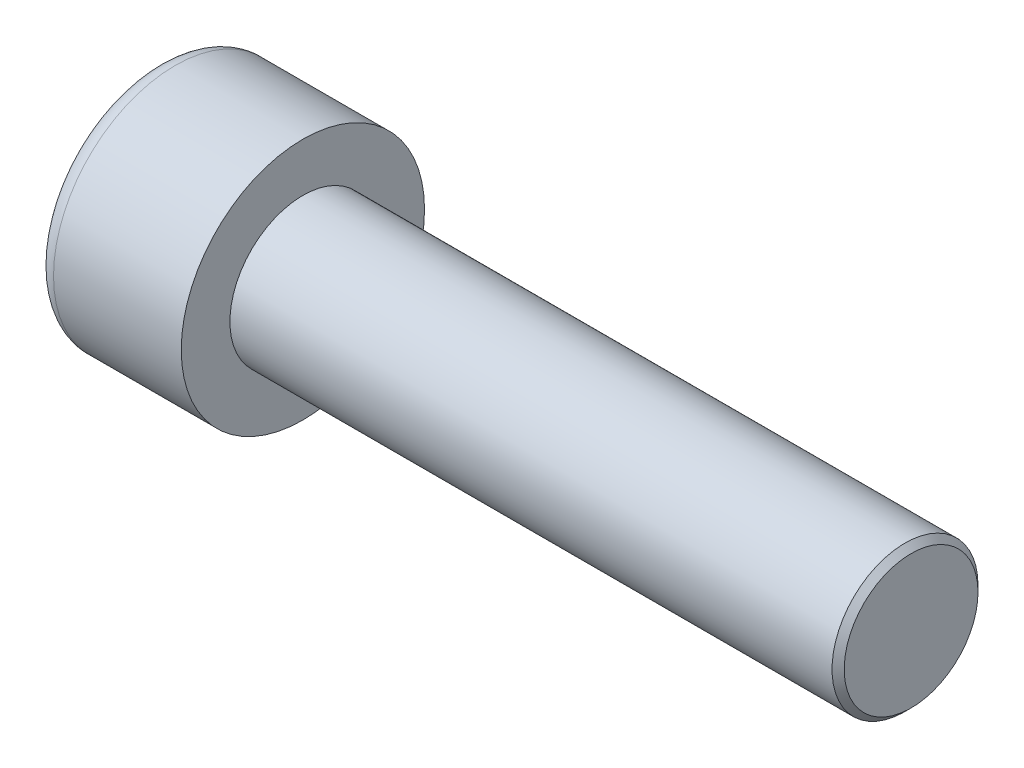
ISO-10303-21;
HEADER;
FILE_DESCRIPTION(('STEP AP214'),'2;1');
FILE_NAME('part.step','',(''),(''),'','','');
FILE_SCHEMA(('AUTOMOTIVE_DESIGN { 1 0 10303 214 1 1 1 1 }'));
ENDSEC;
DATA;
#1=APPLICATION_CONTEXT('core data for automotive mechanical design processes');
#2=APPLICATION_PROTOCOL_DEFINITION('international standard','automotive_design',2000,#1);
#3=PRODUCT_CONTEXT('',#1,'mechanical');
#4=PRODUCT('Part','Part','',(#3));
#5=PRODUCT_RELATED_PRODUCT_CATEGORY('part','',(#4));
#6=PRODUCT_DEFINITION_FORMATION('','',#4);
#7=PRODUCT_DEFINITION_CONTEXT('part definition',#1,'design');
#8=PRODUCT_DEFINITION('design','',#6,#7);
#9=PRODUCT_DEFINITION_SHAPE('','',#8);
#10=(LENGTH_UNIT() NAMED_UNIT(*) SI_UNIT(.MILLI.,.METRE.));
#11=(NAMED_UNIT(*) PLANE_ANGLE_UNIT() SI_UNIT($,.RADIAN.));
#12=(NAMED_UNIT(*) SI_UNIT($,.STERADIAN.) SOLID_ANGLE_UNIT());
#13=UNCERTAINTY_MEASURE_WITH_UNIT(LENGTH_MEASURE(1.E-05),#10,'distance_accuracy_value','');
#14=(GEOMETRIC_REPRESENTATION_CONTEXT(3) GLOBAL_UNCERTAINTY_ASSIGNED_CONTEXT((#13)) GLOBAL_UNIT_ASSIGNED_CONTEXT((#10,
#11,#12)) REPRESENTATION_CONTEXT('',''));
#15=CARTESIAN_POINT('',(0.,0.,0.));
#16=DIRECTION('',(0.,0.,1.));
#17=DIRECTION('',(1.,0.,0.));
#18=AXIS2_PLACEMENT_3D('',#15,#16,#17);
#19=CARTESIAN_POINT('',(3.,0.,-2.88675134594813));
#20=DIRECTION('',(1.,0.,0.));
#21=DIRECTION('',(0.,0.,-1.));
#22=AXIS2_PLACEMENT_3D('',#19,#20,#21);
#23=PLANE('',#22);
#24=CARTESIAN_POINT('',(3.,0.,0.));
#25=DIRECTION('',(1.,0.,0.));
#26=DIRECTION('',(0.,0.,-1.));
#27=AXIS2_PLACEMENT_3D('',#24,#25,#26);
#28=CIRCLE('',#27,2.5);
#29=CARTESIAN_POINT('',(3.,-1.25,-2.1650635094611));
#30=VERTEX_POINT('',#29);
#31=CARTESIAN_POINT('',(3.,-2.5,0.));
#32=VERTEX_POINT('',#31);
#33=EDGE_CURVE('E162',#30,#32,#28,.F.);
#34=ORIENTED_EDGE('',*,*,#33,.F.);
#35=DIRECTION('',(0.,0.866025403784439,-0.5));
#36=VECTOR('',#35,1.);
#37=CARTESIAN_POINT('',(3.,-2.5,-1.44337567297406));
#38=LINE('',#37,#36);
#39=CARTESIAN_POINT('',(3.,-2.5,-1.44337567297406));
#40=VERTEX_POINT('',#39);
#41=EDGE_CURVE('E170',#40,#30,#38,.T.);
#42=ORIENTED_EDGE('',*,*,#41,.F.);
#43=DIRECTION('',(0.,0.,-1.));
#44=VECTOR('',#43,1.);
#45=CARTESIAN_POINT('',(3.,-2.5,1.44337567297406));
#46=LINE('',#45,#44);
#47=EDGE_CURVE('E187',#32,#40,#46,.T.);
#48=ORIENTED_EDGE('',*,*,#47,.F.);
#49=EDGE_LOOP('',(#34,#42,#48));
#50=FACE_BOUND('',#49,.T.);
#51=ADVANCED_FACE('F39',(#50),#23,.F.);
#52=CARTESIAN_POINT('',(3.,-1.25,2.1650635094611));
#53=VERTEX_POINT('',#52);
#54=EDGE_CURVE('E292',#32,#53,#28,.F.);
#55=ORIENTED_EDGE('',*,*,#54,.F.);
#56=CARTESIAN_POINT('',(3.,-2.5,1.44337567297406));
#57=VERTEX_POINT('',#56);
#58=EDGE_CURVE('E188',#57,#32,#46,.T.);
#59=ORIENTED_EDGE('',*,*,#58,.F.);
#60=DIRECTION('',(0.,-0.866025403784439,-0.5));
#61=VECTOR('',#60,1.);
#62=CARTESIAN_POINT('',(3.,0.,2.88675134594813));
#63=LINE('',#62,#61);
#64=EDGE_CURVE('E183',#53,#57,#63,.T.);
#65=ORIENTED_EDGE('',*,*,#64,.F.);
#66=EDGE_LOOP('',(#55,#59,#65));
#67=FACE_BOUND('',#66,.T.);
#68=ADVANCED_FACE('F128',(#67),#23,.F.);
#69=CARTESIAN_POINT('',(3.,1.25,2.1650635094611));
#70=VERTEX_POINT('',#69);
#71=EDGE_CURVE('E288',#53,#70,#28,.F.);
#72=ORIENTED_EDGE('',*,*,#71,.F.);
#73=CARTESIAN_POINT('',(3.,0.,2.88675134594813));
#74=VERTEX_POINT('',#73);
#75=EDGE_CURVE('E184',#74,#53,#63,.T.);
#76=ORIENTED_EDGE('',*,*,#75,.F.);
#77=DIRECTION('',(0.,-0.866025403784439,0.5));
#78=VECTOR('',#77,1.);
#79=CARTESIAN_POINT('',(3.,2.5,1.44337567297406));
#80=LINE('',#79,#78);
#81=EDGE_CURVE('E179',#70,#74,#80,.T.);
#82=ORIENTED_EDGE('',*,*,#81,.F.);
#83=EDGE_LOOP('',(#72,#76,#82));
#84=FACE_BOUND('',#83,.T.);
#85=ADVANCED_FACE('F134',(#84),#23,.F.);
#86=CARTESIAN_POINT('',(3.,2.5,0.));
#87=VERTEX_POINT('',#86);
#88=EDGE_CURVE('E159',#70,#87,#28,.F.);
#89=ORIENTED_EDGE('',*,*,#88,.F.);
#90=CARTESIAN_POINT('',(3.,2.5,1.44337567297406));
#91=VERTEX_POINT('',#90);
#92=EDGE_CURVE('E180',#91,#70,#80,.T.);
#93=ORIENTED_EDGE('',*,*,#92,.F.);
#94=DIRECTION('',(0.,0.,1.));
#95=VECTOR('',#94,1.);
#96=CARTESIAN_POINT('',(3.,2.5,-1.44337567297406));
#97=LINE('',#96,#95);
#98=EDGE_CURVE('E174',#87,#91,#97,.T.);
#99=ORIENTED_EDGE('',*,*,#98,.F.);
#100=EDGE_LOOP('',(#89,#93,#99));
#101=FACE_BOUND('',#100,.T.);
#102=ADVANCED_FACE('F148',(#101),#23,.F.);
#103=CARTESIAN_POINT('',(3.,0.,0.));
#104=DIRECTION('',(1.,0.,0.));
#105=DIRECTION('',(0.,0.,-1.));
#106=AXIS2_PLACEMENT_3D('',#103,#104,#105);
#107=CIRCLE('',#106,2.5);
#108=CARTESIAN_POINT('',(3.,1.25,-2.1650635094611));
#109=VERTEX_POINT('',#108);
#110=EDGE_CURVE('E54',#109,#87,#107,.T.);
#111=ORIENTED_EDGE('',*,*,#110,.T.);
#112=CARTESIAN_POINT('',(3.,2.5,-1.44337567297406));
#113=VERTEX_POINT('',#112);
#114=EDGE_CURVE('E167',#113,#87,#97,.T.);
#115=ORIENTED_EDGE('',*,*,#114,.F.);
#116=DIRECTION('',(0.,0.866025403784438,0.5));
#117=VECTOR('',#116,1.);
#118=CARTESIAN_POINT('',(3.,0.,-2.88675134594813));
#119=LINE('',#118,#117);
#120=EDGE_CURVE('E164',#109,#113,#119,.T.);
#121=ORIENTED_EDGE('',*,*,#120,.F.);
#122=EDGE_LOOP('',(#111,#115,#121));
#123=FACE_BOUND('',#122,.T.);
#124=ADVANCED_FACE('F139',(#123),#23,.F.);
#125=EDGE_CURVE('E152',#109,#30,#28,.F.);
#126=ORIENTED_EDGE('',*,*,#125,.F.);
#127=CARTESIAN_POINT('',(3.,0.,-2.88675134594813));
#128=VERTEX_POINT('',#127);
#129=EDGE_CURVE('E155',#128,#109,#119,.T.);
#130=ORIENTED_EDGE('',*,*,#129,.F.);
#131=EDGE_CURVE('E157',#30,#128,#38,.T.);
#132=ORIENTED_EDGE('',*,*,#131,.F.);
#133=EDGE_LOOP('',(#126,#130,#132));
#134=FACE_BOUND('',#133,.T.);
#135=ADVANCED_FACE('F130',(#134),#23,.F.);
#136=CARTESIAN_POINT('',(0.,0.,0.));
#137=DIRECTION('',(1.,0.,0.));
#138=DIRECTION('',(0.,0.,-1.));
#139=AXIS2_PLACEMENT_3D('',#136,#137,#138);
#140=PLANE('',#139);
#141=CARTESIAN_POINT('',(0.,0.,0.));
#142=DIRECTION('',(1.,0.,0.));
#143=DIRECTION('',(0.,0.,-1.));
#144=AXIS2_PLACEMENT_3D('',#141,#142,#143);
#145=CIRCLE('',#144,4.25);
#146=CARTESIAN_POINT('',(0.,0.,-4.25));
#147=VERTEX_POINT('',#146);
#148=EDGE_CURVE('E227',#147,#147,#145,.F.);
#149=ORIENTED_EDGE('',*,*,#148,.T.);
#150=EDGE_LOOP('',(#149));
#151=FACE_BOUND('',#150,.T.);
#152=DIRECTION('',(0.,0.866025403784439,-0.5));
#153=VECTOR('',#152,1.);
#154=CARTESIAN_POINT('',(0.,-2.5,-1.44337567297406));
#155=LINE('',#154,#153);
#156=CARTESIAN_POINT('',(0.,-2.5,-1.44337567297406));
#157=VERTEX_POINT('',#156);
#158=CARTESIAN_POINT('',(0.,0.,-2.88675134594813));
#159=VERTEX_POINT('',#158);
#160=EDGE_CURVE('E62',#157,#159,#155,.T.);
#161=ORIENTED_EDGE('',*,*,#160,.T.);
#162=DIRECTION('',(0.,0.866025403784438,0.5));
#163=VECTOR('',#162,1.);
#164=CARTESIAN_POINT('',(0.,0.,-2.88675134594813));
#165=LINE('',#164,#163);
#166=CARTESIAN_POINT('',(0.,2.5,-1.44337567297406));
#167=VERTEX_POINT('',#166);
#168=EDGE_CURVE('E193',#159,#167,#165,.T.);
#169=ORIENTED_EDGE('',*,*,#168,.T.);
#170=DIRECTION('',(0.,0.,1.));
#171=VECTOR('',#170,1.);
#172=CARTESIAN_POINT('',(0.,2.5,-1.44337567297406));
#173=LINE('',#172,#171);
#174=CARTESIAN_POINT('',(0.,2.5,1.44337567297406));
#175=VERTEX_POINT('',#174);
#176=EDGE_CURVE('E196',#167,#175,#173,.T.);
#177=ORIENTED_EDGE('',*,*,#176,.T.);
#178=DIRECTION('',(0.,-0.866025403784439,0.5));
#179=VECTOR('',#178,1.);
#180=CARTESIAN_POINT('',(0.,2.5,1.44337567297406));
#181=LINE('',#180,#179);
#182=CARTESIAN_POINT('',(0.,0.,2.88675134594813));
#183=VERTEX_POINT('',#182);
#184=EDGE_CURVE('E199',#175,#183,#181,.T.);
#185=ORIENTED_EDGE('',*,*,#184,.T.);
#186=DIRECTION('',(0.,-0.866025403784439,-0.5));
#187=VECTOR('',#186,1.);
#188=CARTESIAN_POINT('',(0.,0.,2.88675134594813));
#189=LINE('',#188,#187);
#190=CARTESIAN_POINT('',(0.,-2.5,1.44337567297406));
#191=VERTEX_POINT('',#190);
#192=EDGE_CURVE('E202',#183,#191,#189,.T.);
#193=ORIENTED_EDGE('',*,*,#192,.T.);
#194=DIRECTION('',(0.,0.,-1.));
#195=VECTOR('',#194,1.);
#196=CARTESIAN_POINT('',(0.,-2.5,1.44337567297406));
#197=LINE('',#196,#195);
#198=EDGE_CURVE('E205',#191,#157,#197,.T.);
#199=ORIENTED_EDGE('',*,*,#198,.T.);
#200=EDGE_LOOP('',(#161,#169,#177,#185,#193,#199));
#201=FACE_BOUND('',#200,.T.);
#202=ADVANCED_FACE('F138',(#151,#201),#140,.F.);
#203=CARTESIAN_POINT('',(6.,0.,0.));
#204=DIRECTION('',(1.,0.,0.));
#205=DIRECTION('',(0.,0.,-1.));
#206=AXIS2_PLACEMENT_3D('',#203,#204,#205);
#207=PLANE('',#206);
#208=CARTESIAN_POINT('',(6.,0.,0.));
#209=DIRECTION('',(1.,0.,0.));
#210=DIRECTION('',(0.,0.,-1.));
#211=AXIS2_PLACEMENT_3D('',#208,#209,#210);
#212=CIRCLE('',#211,5.);
#213=CARTESIAN_POINT('',(6.,0.,-5.));
#214=VERTEX_POINT('',#213);
#215=EDGE_CURVE('E160',#214,#214,#212,.T.);
#216=ORIENTED_EDGE('',*,*,#215,.T.);
#217=EDGE_LOOP('',(#216));
#218=FACE_BOUND('',#217,.T.);
#219=CARTESIAN_POINT('',(6.,0.,0.));
#220=DIRECTION('',(1.,0.,0.));
#221=DIRECTION('',(0.,0.,-1.));
#222=AXIS2_PLACEMENT_3D('',#219,#220,#221);
#223=CIRCLE('',#222,3.);
#224=CARTESIAN_POINT('',(6.,0.,-3.));
#225=VERTEX_POINT('',#224);
#226=EDGE_CURVE('E218',#225,#225,#223,.T.);
#227=ORIENTED_EDGE('',*,*,#226,.F.);
#228=EDGE_LOOP('',(#227));
#229=FACE_BOUND('',#228,.T.);
#230=ADVANCED_FACE('F145',(#218,#229),#207,.T.);
#231=CARTESIAN_POINT('',(6.,0.,0.));
#232=DIRECTION('',(-1.,0.,0.));
#233=DIRECTION('',(0.,0.,1.));
#234=AXIS2_PLACEMENT_3D('',#231,#232,#233);
#235=CYLINDRICAL_SURFACE('',#234,5.);
#236=CARTESIAN_POINT('',(0.75,0.,0.));
#237=DIRECTION('',(1.,0.,0.));
#238=DIRECTION('',(0.,0.,-1.));
#239=AXIS2_PLACEMENT_3D('',#236,#237,#238);
#240=CIRCLE('',#239,5.);
#241=CARTESIAN_POINT('',(0.75,0.,-5.));
#242=VERTEX_POINT('',#241);
#243=EDGE_CURVE('E224',#242,#242,#240,.T.);
#244=ORIENTED_EDGE('',*,*,#243,.T.);
#245=EDGE_LOOP('',(#244));
#246=FACE_BOUND('',#245,.T.);
#247=ORIENTED_EDGE('',*,*,#215,.F.);
#248=EDGE_LOOP('',(#247));
#249=FACE_BOUND('',#248,.T.);
#250=ADVANCED_FACE('F243',(#246,#249),#235,.T.);
#251=CARTESIAN_POINT('',(31.,0.,0.));
#252=DIRECTION('',(-1.,0.,0.));
#253=DIRECTION('',(0.,0.,1.));
#254=AXIS2_PLACEMENT_3D('',#251,#252,#253);
#255=CYLINDRICAL_SURFACE('',#254,3.);
#256=CARTESIAN_POINT('',(30.75,0.,0.));
#257=DIRECTION('',(1.,0.,0.));
#258=DIRECTION('',(0.,0.,-1.));
#259=AXIS2_PLACEMENT_3D('',#256,#257,#258);
#260=CIRCLE('',#259,3.);
#261=CARTESIAN_POINT('',(30.75,0.,-3.));
#262=VERTEX_POINT('',#261);
#263=EDGE_CURVE('E11',#262,#262,#260,.F.);
#264=ORIENTED_EDGE('',*,*,#263,.T.);
#265=EDGE_LOOP('',(#264));
#266=FACE_BOUND('',#265,.T.);
#267=ORIENTED_EDGE('',*,*,#226,.T.);
#268=EDGE_LOOP('',(#267));
#269=FACE_BOUND('',#268,.T.);
#270=ADVANCED_FACE('F240',(#266,#269),#255,.T.);
#271=CARTESIAN_POINT('',(31.,0.,0.));
#272=DIRECTION('',(1.,0.,0.));
#273=DIRECTION('',(0.,0.,-1.));
#274=AXIS2_PLACEMENT_3D('',#271,#272,#273);
#275=PLANE('',#274);
#276=CARTESIAN_POINT('',(31.,0.,0.));
#277=DIRECTION('',(1.,0.,0.));
#278=DIRECTION('',(0.,0.,-1.));
#279=AXIS2_PLACEMENT_3D('',#276,#277,#278);
#280=CIRCLE('',#279,2.75);
#281=CARTESIAN_POINT('',(31.,0.,-2.75));
#282=VERTEX_POINT('',#281);
#283=EDGE_CURVE('E47',#282,#282,#280,.T.);
#284=ORIENTED_EDGE('',*,*,#283,.T.);
#285=EDGE_LOOP('',(#284));
#286=FACE_BOUND('',#285,.T.);
#287=ADVANCED_FACE('F232',(#286),#275,.T.);
#288=CARTESIAN_POINT('',(3.,-2.5,-1.44337567297406));
#289=DIRECTION('',(0.,0.5,0.866025403784439));
#290=DIRECTION('',(0.,-0.866025403784439,0.5));
#291=AXIS2_PLACEMENT_3D('',#288,#289,#290);
#292=PLANE('',#291);
#293=ORIENTED_EDGE('',*,*,#160,.F.);
#294=DIRECTION('',(-1.,0.,0.));
#295=VECTOR('',#294,1.);
#296=CARTESIAN_POINT('',(3.,-2.5,-1.44337567297406));
#297=LINE('',#296,#295);
#298=EDGE_CURVE('E191',#40,#157,#297,.T.);
#299=ORIENTED_EDGE('',*,*,#298,.F.);
#300=ORIENTED_EDGE('',*,*,#41,.T.);
#301=ORIENTED_EDGE('',*,*,#131,.T.);
#302=DIRECTION('',(-1.,0.,0.));
#303=VECTOR('',#302,1.);
#304=CARTESIAN_POINT('',(3.,0.,-2.88675134594813));
#305=LINE('',#304,#303);
#306=EDGE_CURVE('E173',#128,#159,#305,.T.);
#307=ORIENTED_EDGE('',*,*,#306,.T.);
#308=EDGE_LOOP('',(#293,#299,#300,#301,#307));
#309=FACE_BOUND('',#308,.T.);
#310=ADVANCED_FACE('F258',(#309),#292,.T.);
#311=CARTESIAN_POINT('',(3.,0.,-2.88675134594813));
#312=DIRECTION('',(0.,-0.5,0.866025403784438));
#313=DIRECTION('',(0.,-0.866025403784439,-0.5));
#314=AXIS2_PLACEMENT_3D('',#311,#312,#313);
#315=PLANE('',#314);
#316=ORIENTED_EDGE('',*,*,#168,.F.);
#317=ORIENTED_EDGE('',*,*,#306,.F.);
#318=ORIENTED_EDGE('',*,*,#129,.T.);
#319=ORIENTED_EDGE('',*,*,#120,.T.);
#320=DIRECTION('',(-1.,0.,0.));
#321=VECTOR('',#320,1.);
#322=CARTESIAN_POINT('',(3.,2.5,-1.44337567297406));
#323=LINE('',#322,#321);
#324=EDGE_CURVE('E215',#113,#167,#323,.T.);
#325=ORIENTED_EDGE('',*,*,#324,.T.);
#326=EDGE_LOOP('',(#316,#317,#318,#319,#325));
#327=FACE_BOUND('',#326,.T.);
#328=ADVANCED_FACE('F172',(#327),#315,.T.);
#329=CARTESIAN_POINT('',(3.,2.5,-1.44337567297406));
#330=DIRECTION('',(0.,-1.,0.));
#331=DIRECTION('',(0.,0.,-1.));
#332=AXIS2_PLACEMENT_3D('',#329,#330,#331);
#333=PLANE('',#332);
#334=ORIENTED_EDGE('',*,*,#176,.F.);
#335=ORIENTED_EDGE('',*,*,#324,.F.);
#336=ORIENTED_EDGE('',*,*,#114,.T.);
#337=ORIENTED_EDGE('',*,*,#98,.T.);
#338=DIRECTION('',(-1.,0.,0.));
#339=VECTOR('',#338,1.);
#340=CARTESIAN_POINT('',(3.,2.5,1.44337567297406));
#341=LINE('',#340,#339);
#342=EDGE_CURVE('E213',#91,#175,#341,.T.);
#343=ORIENTED_EDGE('',*,*,#342,.T.);
#344=EDGE_LOOP('',(#334,#335,#336,#337,#343));
#345=FACE_BOUND('',#344,.T.);
#346=ADVANCED_FACE('F263',(#345),#333,.T.);
#347=CARTESIAN_POINT('',(3.,2.5,1.44337567297406));
#348=DIRECTION('',(0.,-0.5,-0.866025403784439));
#349=DIRECTION('',(0.,0.866025403784439,-0.5));
#350=AXIS2_PLACEMENT_3D('',#347,#348,#349);
#351=PLANE('',#350);
#352=ORIENTED_EDGE('',*,*,#184,.F.);
#353=ORIENTED_EDGE('',*,*,#342,.F.);
#354=ORIENTED_EDGE('',*,*,#92,.T.);
#355=ORIENTED_EDGE('',*,*,#81,.T.);
#356=DIRECTION('',(-1.,0.,0.));
#357=VECTOR('',#356,1.);
#358=CARTESIAN_POINT('',(3.,0.,2.88675134594813));
#359=LINE('',#358,#357);
#360=EDGE_CURVE('E211',#74,#183,#359,.T.);
#361=ORIENTED_EDGE('',*,*,#360,.T.);
#362=EDGE_LOOP('',(#352,#353,#354,#355,#361));
#363=FACE_BOUND('',#362,.T.);
#364=ADVANCED_FACE('F266',(#363),#351,.T.);
#365=CARTESIAN_POINT('',(3.,0.,2.88675134594813));
#366=DIRECTION('',(0.,0.5,-0.866025403784438));
#367=DIRECTION('',(0.,0.866025403784439,0.5));
#368=AXIS2_PLACEMENT_3D('',#365,#366,#367);
#369=PLANE('',#368);
#370=ORIENTED_EDGE('',*,*,#192,.F.);
#371=ORIENTED_EDGE('',*,*,#360,.F.);
#372=ORIENTED_EDGE('',*,*,#75,.T.);
#373=ORIENTED_EDGE('',*,*,#64,.T.);
#374=DIRECTION('',(-1.,0.,0.));
#375=VECTOR('',#374,1.);
#376=CARTESIAN_POINT('',(3.,-2.5,1.44337567297406));
#377=LINE('',#376,#375);
#378=EDGE_CURVE('E209',#57,#191,#377,.T.);
#379=ORIENTED_EDGE('',*,*,#378,.T.);
#380=EDGE_LOOP('',(#370,#371,#372,#373,#379));
#381=FACE_BOUND('',#380,.T.);
#382=ADVANCED_FACE('F123',(#381),#369,.T.);
#383=CARTESIAN_POINT('',(3.,-2.5,1.44337567297406));
#384=DIRECTION('',(0.,1.,0.));
#385=DIRECTION('',(0.,0.,1.));
#386=AXIS2_PLACEMENT_3D('',#383,#384,#385);
#387=PLANE('',#386);
#388=ORIENTED_EDGE('',*,*,#198,.F.);
#389=ORIENTED_EDGE('',*,*,#378,.F.);
#390=ORIENTED_EDGE('',*,*,#58,.T.);
#391=ORIENTED_EDGE('',*,*,#47,.T.);
#392=ORIENTED_EDGE('',*,*,#298,.T.);
#393=EDGE_LOOP('',(#388,#389,#390,#391,#392));
#394=FACE_BOUND('',#393,.T.);
#395=ADVANCED_FACE('F116',(#394),#387,.T.);
#396=CARTESIAN_POINT('',(3.,0.,0.));
#397=DIRECTION('',(-1.,0.,0.));
#398=DIRECTION('',(0.,0.,1.));
#399=AXIS2_PLACEMENT_3D('',#396,#397,#398);
#400=CONICAL_SURFACE('',#399,2.5,1.04719755119659);
#401=CARTESIAN_POINT('',(4.44337567297408,0.,0.));
#402=VERTEX_POINT('',#401);
#403=VERTEX_LOOP('',#402);
#404=FACE_BOUND('',#403,.T.);
#405=ORIENTED_EDGE('',*,*,#110,.F.);
#406=ORIENTED_EDGE('',*,*,#125,.T.);
#407=ORIENTED_EDGE('',*,*,#33,.T.);
#408=ORIENTED_EDGE('',*,*,#54,.T.);
#409=ORIENTED_EDGE('',*,*,#71,.T.);
#410=ORIENTED_EDGE('',*,*,#88,.T.);
#411=EDGE_LOOP('',(#405,#406,#407,#408,#409,#410));
#412=FACE_BOUND('',#411,.T.);
#413=ADVANCED_FACE('F113',(#404,#412),#400,.F.);
#414=CARTESIAN_POINT('',(0.75,0.,0.));
#415=DIRECTION('',(1.,0.,0.));
#416=DIRECTION('',(0.,0.,-1.));
#417=AXIS2_PLACEMENT_3D('',#414,#415,#416);
#418=TOROIDAL_SURFACE('',#417,4.25,0.75);
#419=ORIENTED_EDGE('',*,*,#148,.F.);
#420=EDGE_LOOP('',(#419));
#421=FACE_BOUND('',#420,.T.);
#422=ORIENTED_EDGE('',*,*,#243,.F.);
#423=EDGE_LOOP('',(#422));
#424=FACE_BOUND('',#423,.T.);
#425=ADVANCED_FACE('F115',(#421,#424),#418,.T.);
#426=CARTESIAN_POINT('',(31.,0.,0.));
#427=DIRECTION('',(-1.,0.,0.));
#428=DIRECTION('',(0.,0.,1.));
#429=AXIS2_PLACEMENT_3D('',#426,#427,#428);
#430=CONICAL_SURFACE('',#429,2.75,0.785398163397444);
#431=ORIENTED_EDGE('',*,*,#263,.F.);
#432=EDGE_LOOP('',(#431));
#433=FACE_BOUND('',#432,.T.);
#434=ORIENTED_EDGE('',*,*,#283,.F.);
#435=EDGE_LOOP('',(#434));
#436=FACE_BOUND('',#435,.T.);
#437=ADVANCED_FACE('F41',(#433,#436),#430,.T.);
#438=CLOSED_SHELL('',(#51,#68,#85,#102,#124,#135,#202,#230,#250,#270,#287,#310,#328,#346,#364,
#382,#395,#413,#425,#437));
#439=MANIFOLD_SOLID_BREP('B2',#438);
#440=ADVANCED_BREP_SHAPE_REPRESENTATION('',(#18,#439),#14);
#441=SHAPE_DEFINITION_REPRESENTATION(#9,#440);
ENDSEC;
END-ISO-10303-21;
